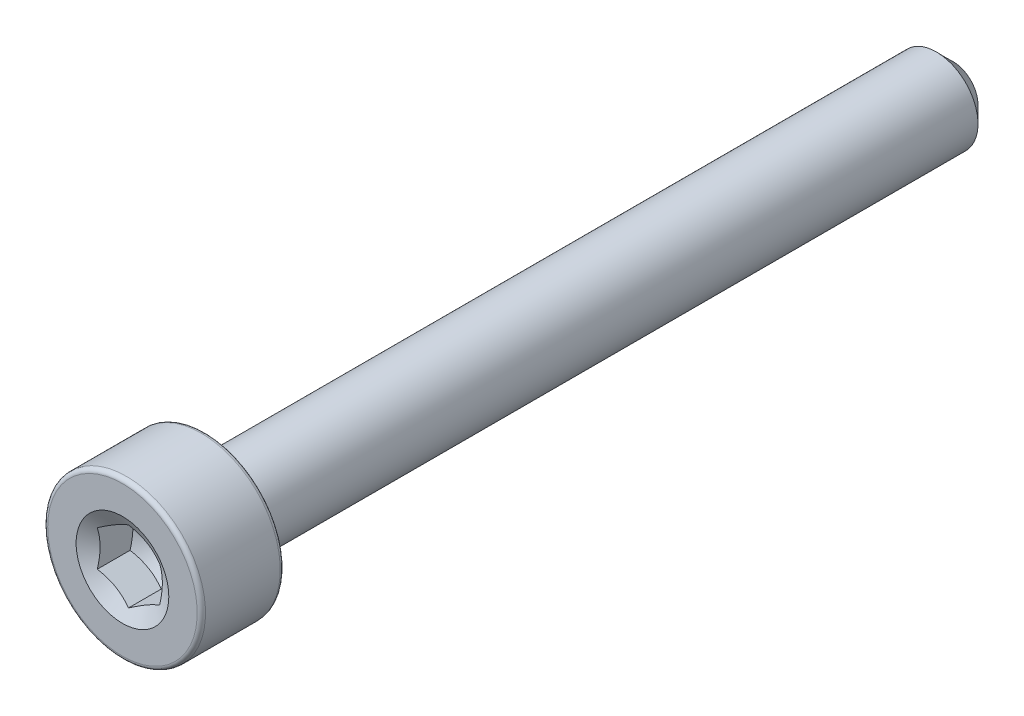
ISO-10303-21;
HEADER;
FILE_DESCRIPTION(('STEP AP214'),'2;1');
FILE_NAME('part.step','',(''),(''),'','','');
FILE_SCHEMA(('AUTOMOTIVE_DESIGN { 1 0 10303 214 1 1 1 1 }'));
ENDSEC;
DATA;
#1=APPLICATION_CONTEXT('core data for automotive mechanical design processes');
#2=APPLICATION_PROTOCOL_DEFINITION('international standard','automotive_design',2000,#1);
#3=PRODUCT_CONTEXT('',#1,'mechanical');
#4=PRODUCT('Part','Part','',(#3));
#5=PRODUCT_RELATED_PRODUCT_CATEGORY('part','',(#4));
#6=PRODUCT_DEFINITION_FORMATION('','',#4);
#7=PRODUCT_DEFINITION_CONTEXT('part definition',#1,'design');
#8=PRODUCT_DEFINITION('design','',#6,#7);
#9=PRODUCT_DEFINITION_SHAPE('','',#8);
#10=(LENGTH_UNIT() NAMED_UNIT(*) SI_UNIT(.MILLI.,.METRE.));
#11=(NAMED_UNIT(*) PLANE_ANGLE_UNIT() SI_UNIT($,.RADIAN.));
#12=(NAMED_UNIT(*) SI_UNIT($,.STERADIAN.) SOLID_ANGLE_UNIT());
#13=UNCERTAINTY_MEASURE_WITH_UNIT(LENGTH_MEASURE(1.E-05),#10,'distance_accuracy_value','');
#14=(GEOMETRIC_REPRESENTATION_CONTEXT(3) GLOBAL_UNCERTAINTY_ASSIGNED_CONTEXT((#13)) GLOBAL_UNIT_ASSIGNED_CONTEXT((#10,
#11,#12)) REPRESENTATION_CONTEXT('',''));
#15=CARTESIAN_POINT('',(0.,0.,0.));
#16=DIRECTION('',(0.,0.,1.));
#17=DIRECTION('',(1.,0.,0.));
#18=AXIS2_PLACEMENT_3D('',#15,#16,#17);
#19=CARTESIAN_POINT('',(0.,0.,-10.));
#20=DIRECTION('',(0.,0.,-1.));
#21=DIRECTION('',(-1.,0.,0.));
#22=AXIS2_PLACEMENT_3D('',#19,#20,#21);
#23=PLANE('',#22);
#24=CARTESIAN_POINT('',(0.,0.,-10.));
#25=DIRECTION('',(0.,0.,-1.));
#26=DIRECTION('',(-1.,0.,0.));
#27=AXIS2_PLACEMENT_3D('',#24,#25,#26);
#28=CIRCLE('',#27,0.600000000000008);
#29=CARTESIAN_POINT('',(-0.600000000000008,0.,-10.));
#30=VERTEX_POINT('',#29);
#31=EDGE_CURVE('E48',#30,#30,#28,.T.);
#32=ORIENTED_EDGE('',*,*,#31,.T.);
#33=EDGE_LOOP('',(#32));
#34=FACE_BOUND('',#33,.T.);
#35=ADVANCED_FACE('F35',(#34),#23,.T.);
#36=CARTESIAN_POINT('',(0.,0.,-10.));
#37=DIRECTION('',(0.,0.,1.));
#38=DIRECTION('',(1.,0.,0.));
#39=AXIS2_PLACEMENT_3D('',#36,#37,#38);
#40=CONICAL_SURFACE('',#39,0.600000000000008,0.785398163397452);
#41=CARTESIAN_POINT('',(0.,0.,-9.6));
#42=DIRECTION('',(0.,0.,-1.));
#43=DIRECTION('',(-1.,0.,0.));
#44=AXIS2_PLACEMENT_3D('',#41,#42,#43);
#45=CIRCLE('',#44,1.00000000000001);
#46=CARTESIAN_POINT('',(-1.00000000000001,0.,-9.6));
#47=VERTEX_POINT('',#46);
#48=EDGE_CURVE('E234',#47,#47,#45,.T.);
#49=ORIENTED_EDGE('',*,*,#48,.T.);
#50=EDGE_LOOP('',(#49));
#51=FACE_BOUND('',#50,.T.);
#52=ORIENTED_EDGE('',*,*,#31,.F.);
#53=EDGE_LOOP('',(#52));
#54=FACE_BOUND('',#53,.T.);
#55=ADVANCED_FACE('F224',(#51,#54),#40,.T.);
#56=CARTESIAN_POINT('',(0.,0.,-10.));
#57=DIRECTION('',(0.,0.,-1.));
#58=DIRECTION('',(-1.,0.,0.));
#59=AXIS2_PLACEMENT_3D('',#56,#57,#58);
#60=CYLINDRICAL_SURFACE('',#59,1.00000000000001);
#61=CARTESIAN_POINT('',(0.,0.,8.));
#62=DIRECTION('',(0.,0.,-1.));
#63=DIRECTION('',(-1.,0.,0.));
#64=AXIS2_PLACEMENT_3D('',#61,#62,#63);
#65=CIRCLE('',#64,1.00000000000001);
#66=CARTESIAN_POINT('',(-1.00000000000001,0.,8.));
#67=VERTEX_POINT('',#66);
#68=EDGE_CURVE('E236',#67,#67,#65,.T.);
#69=ORIENTED_EDGE('',*,*,#68,.T.);
#70=EDGE_LOOP('',(#69));
#71=FACE_BOUND('',#70,.T.);
#72=ORIENTED_EDGE('',*,*,#48,.F.);
#73=EDGE_LOOP('',(#72));
#74=FACE_BOUND('',#73,.T.);
#75=ADVANCED_FACE('F229',(#71,#74),#60,.T.);
#76=CARTESIAN_POINT('',(0.,1.,8.));
#77=DIRECTION('',(0.,0.,-1.));
#78=DIRECTION('',(-1.,0.,0.));
#79=AXIS2_PLACEMENT_3D('',#76,#77,#78);
#80=PLANE('',#79);
#81=CARTESIAN_POINT('',(0.,0.,8.));
#82=DIRECTION('',(0.,0.,-1.));
#83=DIRECTION('',(-1.,0.,0.));
#84=AXIS2_PLACEMENT_3D('',#81,#82,#83);
#85=CIRCLE('',#84,1.8);
#86=CARTESIAN_POINT('',(-1.8,0.,8.));
#87=VERTEX_POINT('',#86);
#88=EDGE_CURVE('E241',#87,#87,#85,.T.);
#89=ORIENTED_EDGE('',*,*,#88,.T.);
#90=EDGE_LOOP('',(#89));
#91=FACE_BOUND('',#90,.T.);
#92=ORIENTED_EDGE('',*,*,#68,.F.);
#93=EDGE_LOOP('',(#92));
#94=FACE_BOUND('',#93,.T.);
#95=ADVANCED_FACE('F325',(#91,#94),#80,.T.);
#96=CARTESIAN_POINT('',(0.,0.,8.1));
#97=DIRECTION('',(0.,0.,-1.));
#98=DIRECTION('',(-1.,0.,0.));
#99=AXIS2_PLACEMENT_3D('',#96,#97,#98);
#100=TOROIDAL_SURFACE('',#99,1.8,0.0999999999999996);
#101=CARTESIAN_POINT('',(0.,0.,8.1));
#102=DIRECTION('',(0.,0.,-1.));
#103=DIRECTION('',(-1.,0.,0.));
#104=AXIS2_PLACEMENT_3D('',#101,#102,#103);
#105=CIRCLE('',#104,1.9);
#106=CARTESIAN_POINT('',(-1.9,0.,8.1));
#107=VERTEX_POINT('',#106);
#108=EDGE_CURVE('E244',#107,#107,#105,.T.);
#109=ORIENTED_EDGE('',*,*,#108,.T.);
#110=EDGE_LOOP('',(#109));
#111=FACE_BOUND('',#110,.T.);
#112=ORIENTED_EDGE('',*,*,#88,.F.);
#113=EDGE_LOOP('',(#112));
#114=FACE_BOUND('',#113,.T.);
#115=ADVANCED_FACE('F318',(#111,#114),#100,.T.);
#116=CARTESIAN_POINT('',(0.,0.,-10.));
#117=DIRECTION('',(0.,0.,-1.));
#118=DIRECTION('',(-1.,0.,0.));
#119=AXIS2_PLACEMENT_3D('',#116,#117,#118);
#120=CYLINDRICAL_SURFACE('',#119,1.9);
#121=CARTESIAN_POINT('',(0.,0.,9.9));
#122=DIRECTION('',(0.,0.,-1.));
#123=DIRECTION('',(-1.,0.,0.));
#124=AXIS2_PLACEMENT_3D('',#121,#122,#123);
#125=CIRCLE('',#124,1.9);
#126=CARTESIAN_POINT('',(-1.9,0.,9.9));
#127=VERTEX_POINT('',#126);
#128=EDGE_CURVE('E246',#127,#127,#125,.T.);
#129=ORIENTED_EDGE('',*,*,#128,.T.);
#130=EDGE_LOOP('',(#129));
#131=FACE_BOUND('',#130,.T.);
#132=ORIENTED_EDGE('',*,*,#108,.F.);
#133=EDGE_LOOP('',(#132));
#134=FACE_BOUND('',#133,.T.);
#135=ADVANCED_FACE('F263',(#131,#134),#120,.T.);
#136=CARTESIAN_POINT('',(0.,0.,9.9));
#137=DIRECTION('',(0.,0.,-1.));
#138=DIRECTION('',(-1.,0.,0.));
#139=AXIS2_PLACEMENT_3D('',#136,#137,#138);
#140=TOROIDAL_SURFACE('',#139,1.8,0.0999999999999996);
#141=CARTESIAN_POINT('',(0.,0.,10.));
#142=DIRECTION('',(0.,0.,-1.));
#143=DIRECTION('',(-1.,0.,0.));
#144=AXIS2_PLACEMENT_3D('',#141,#142,#143);
#145=CIRCLE('',#144,1.8);
#146=CARTESIAN_POINT('',(-1.8,0.,10.));
#147=VERTEX_POINT('',#146);
#148=EDGE_CURVE('E122',#147,#147,#145,.T.);
#149=ORIENTED_EDGE('',*,*,#148,.T.);
#150=EDGE_LOOP('',(#149));
#151=FACE_BOUND('',#150,.T.);
#152=ORIENTED_EDGE('',*,*,#128,.F.);
#153=EDGE_LOOP('',(#152));
#154=FACE_BOUND('',#153,.T.);
#155=ADVANCED_FACE('F253',(#151,#154),#140,.T.);
#156=CARTESIAN_POINT('',(0.,1.79999999999999,10.));
#157=DIRECTION('',(0.,0.,1.));
#158=DIRECTION('',(1.,0.,0.));
#159=AXIS2_PLACEMENT_3D('',#156,#157,#158);
#160=PLANE('',#159);
#161=CARTESIAN_POINT('',(0.,0.,10.));
#162=DIRECTION('',(0.,0.,1.));
#163=DIRECTION('',(1.,0.,0.));
#164=AXIS2_PLACEMENT_3D('',#161,#162,#163);
#165=CIRCLE('',#164,1.11602540378444);
#166=CARTESIAN_POINT('',(1.11602540378444,0.,10.));
#167=VERTEX_POINT('',#166);
#168=EDGE_CURVE('E266',#167,#167,#165,.T.);
#169=ORIENTED_EDGE('',*,*,#168,.F.);
#170=EDGE_LOOP('',(#169));
#171=FACE_BOUND('',#170,.T.);
#172=ORIENTED_EDGE('',*,*,#148,.F.);
#173=EDGE_LOOP('',(#172));
#174=FACE_BOUND('',#173,.T.);
#175=ADVANCED_FACE('F133',(#171,#174),#160,.T.);
#176=CARTESIAN_POINT('',(0.,0.,10.));
#177=DIRECTION('',(0.,0.,1.));
#178=DIRECTION('',(1.,0.,0.));
#179=AXIS2_PLACEMENT_3D('',#176,#177,#178);
#180=CONICAL_SURFACE('',#179,1.11602540378444,1.0471975511966);
#181=ORIENTED_EDGE('',*,*,#168,.T.);
#182=EDGE_LOOP('',(#181));
#183=FACE_BOUND('',#182,.T.);
#184=CARTESIAN_POINT('',(0.750199999999995,0.432897231838378,9.85572911270082));
#185=CARTESIAN_POINT('',(0.717238666575999,0.451927466563571,9.844734465448));
#186=CARTESIAN_POINT('',(0.683992818696244,0.471121965786385,9.83473457387216));
#187=CARTESIAN_POINT('',(0.616925218141238,0.50984346302072,9.81727814462867));
#188=CARTESIAN_POINT('',(0.583102272153648,0.529371149991441,9.80982778503158));
#189=CARTESIAN_POINT('',(0.515875632570357,0.568184468451568,9.79822813644186));
#190=CARTESIAN_POINT('',(0.482482293499608,0.587464121753206,9.79400168090746));
#191=CARTESIAN_POINT('',(0.4155381739113,0.626114327218178,9.78895257864927));
#192=CARTESIAN_POINT('',(0.381987637355581,0.645484738530079,9.78812575463677));
#193=CARTESIAN_POINT('',(0.319275698978877,0.681691493033272,9.78982920074236));
#194=CARTESIAN_POINT('',(0.290104995811369,0.698533206359483,9.79194121207614));
#195=CARTESIAN_POINT('',(0.231953671848453,0.732106888903206,9.79864022050677));
#196=CARTESIAN_POINT('',(0.202973252776871,0.748838741655412,9.80322951465607));
#197=CARTESIAN_POINT('',(0.14470165065519,0.782481866826475,9.81470442958304));
#198=CARTESIAN_POINT('',(0.115417857581379,0.799388872640534,9.82163878037239));
#199=CARTESIAN_POINT('',(0.0572874895838308,0.83295045625201,9.83737781029697));
#200=CARTESIAN_POINT('',(0.0284401676519281,0.849605465334794,9.84617878188886));
#201=CARTESIAN_POINT('',(-0.000200000000000187,0.86614087383827,9.85572911270082));
#202=B_SPLINE_CURVE_WITH_KNOTS('',3,(#184,#185,#186,#187,#188,#189,#190,#191,#192,#193,#194,
#195,#196,#197,#198,#199,#200,#201),.UNSPECIFIED.,.F.,.F.,(4,2,2,2,2,2,2,2,4),(0.,
0.118896819359342,0.238079744533806,0.354311719456402,0.470400831872516,0.571553114284105,
0.672799351342652,0.776293900714044,0.879584779344043),.UNSPECIFIED.);
#203=CARTESIAN_POINT('',(0.749999999999995,0.433012701892216,9.8556624327026));
#204=VERTEX_POINT('',#203);
#205=CARTESIAN_POINT('',(0.,0.866025403784432,9.8556624327026));
#206=VERTEX_POINT('',#205);
#207=EDGE_CURVE('E105',#204,#206,#202,.T.);
#208=ORIENTED_EDGE('',*,*,#207,.F.);
#209=CARTESIAN_POINT('',(0.749999999999995,-1.15306564243728,10.149820346422));
#210=CARTESIAN_POINT('',(0.749999999999995,-1.12038013476138,10.1340040192738));
#211=CARTESIAN_POINT('',(0.749999999999995,-1.08761885655996,10.1183449923525));
#212=CARTESIAN_POINT('',(0.749999999999995,-1.02190345027715,10.087423399602));
#213=CARTESIAN_POINT('',(0.749999999999995,-0.988949291795743,10.0721608984503));
#214=CARTESIAN_POINT('',(0.749999999999995,-0.889385711742106,10.0269325139052));
#215=CARTESIAN_POINT('',(0.749999999999995,-0.822435952381775,9.99770261181999));
#216=CARTESIAN_POINT('',(0.749999999999995,-0.685214684307736,9.94149405530837));
#217=CARTESIAN_POINT('',(0.749999999999995,-0.614903922449347,9.91461006312454));
#218=CARTESIAN_POINT('',(0.749999999999995,-0.472489622951485,9.86636033068312));
#219=CARTESIAN_POINT('',(0.749999999999995,-0.400390831340974,9.84498140445166));
#220=CARTESIAN_POINT('',(0.749999999999995,-0.290845866621627,9.81969809707652));
#221=CARTESIAN_POINT('',(0.749999999999995,-0.254190393438377,9.81241088336631));
#222=CARTESIAN_POINT('',(0.749999999999995,-0.180433464698268,9.8005602351846));
#223=CARTESIAN_POINT('',(0.749999999999995,-0.143332051443239,9.79599654440802));
#224=CARTESIAN_POINT('',(0.749999999999995,-0.0693492730770007,9.79001551285672));
#225=CARTESIAN_POINT('',(0.749999999999995,-0.0324712047402484,9.78855850283831));
#226=CARTESIAN_POINT('',(0.749999999999995,0.0412735455883394,9.78880667745323));
#227=CARTESIAN_POINT('',(0.749999999999995,0.0781402270398259,9.79051199426122));
#228=CARTESIAN_POINT('',(0.749999999999995,0.167158676596212,9.79829783053029));
#229=CARTESIAN_POINT('',(0.749999999999995,0.219175882572991,9.80592459994543));
#230=CARTESIAN_POINT('',(0.749999999999995,0.322252348155704,9.82611456877775));
#231=CARTESIAN_POINT('',(0.749999999999995,0.373310451134433,9.83868337195179));
#232=CARTESIAN_POINT('',(0.749999999999995,0.475553995689897,9.86772435118418));
#233=CARTESIAN_POINT('',(0.749999999999995,0.526715064342417,9.88428009146391));
#234=CARTESIAN_POINT('',(0.749999999999995,0.628087874613356,9.91998725823706));
#235=CARTESIAN_POINT('',(0.749999999999995,0.678299881547945,9.93913794669093));
#236=CARTESIAN_POINT('',(0.749999999999995,0.812229232348719,9.99298526882848));
#237=CARTESIAN_POINT('',(0.749999999999995,0.895278140104571,10.0293270483095));
#238=CARTESIAN_POINT('',(0.749999999999995,1.06008280877548,10.1048396276005));
#239=CARTESIAN_POINT('',(0.749999999999995,1.14183809619828,10.1440114353385));
#240=CARTESIAN_POINT('',(0.749999999999995,1.30462051464699,10.2241336520939));
#241=CARTESIAN_POINT('',(0.749999999999995,1.38564638020701,10.2650866225652));
#242=CARTESIAN_POINT('',(0.749999999999995,1.54711446948511,10.3480870099448));
#243=CARTESIAN_POINT('',(0.749999999999995,1.62755679099578,10.3901342377892));
#244=CARTESIAN_POINT('',(0.749999999999995,1.77972541583155,10.4705750296754));
#245=CARTESIAN_POINT('',(0.749999999999995,1.85149053346193,10.508895325344));
#246=CARTESIAN_POINT('',(0.749999999999995,1.99478895544011,10.5859749320338));
#247=CARTESIAN_POINT('',(0.749999999999995,2.06632224789951,10.6247342651255));
#248=CARTESIAN_POINT('',(0.749999999999995,2.20899357077631,10.7024604591111));
#249=CARTESIAN_POINT('',(0.749999999999995,2.28013214156243,10.7414263293028));
#250=CARTESIAN_POINT('',(0.749999999999995,2.42226538717498,10.8196086100366));
#251=CARTESIAN_POINT('',(0.749999999999995,2.49326007122855,10.8588250037974));
#252=CARTESIAN_POINT('',(0.749999999999995,2.56420394114665,10.8981325136433));
#253=B_SPLINE_CURVE_WITH_KNOTS('',3,(#209,#210,#211,#212,#213,#214,#215,#216,#217,#218,#219,
#220,#221,#222,#223,#224,#225,#226,#227,#228,#229,#230,#231,#232,#233,#234,#235,#236,#237,#238,
#239,#240,#241,#242,#243,#244,#245,#246,#247,#248,#249,#250,#251,#252),.UNSPECIFIED.,.F.,.F.,(4,
2,2,2,2,2,2,2,2,2,2,2,2,2,2,2,2,2,2,2,2,4),(0.,0.108931784246396,0.217881226266119,
0.436985147205167,0.662706864209844,0.887882785097108,0.999918258084864,1.11194318598395,
1.22252888150385,1.33311919923941,1.49051448653736,1.64808876093355,1.80930789324034,
1.97048126844009,2.24232664131636,2.51426931510376,2.78661690583715,3.05891774918372,
3.30298150798587,3.54705759078482,3.79039079075098,4.0337078585585),.UNSPECIFIED.);
#254=CARTESIAN_POINT('',(0.749999999999994,-0.433012701892216,9.85566243270259));
#255=VERTEX_POINT('',#254);
#256=EDGE_CURVE('E187',#255,#204,#253,.T.);
#257=ORIENTED_EDGE('',*,*,#256,.F.);
#258=CARTESIAN_POINT('',(-0.000200000000000048,-0.86614087383827,9.85572911270081));
#259=CARTESIAN_POINT('',(0.0327613334239947,-0.847110639113078,9.84473446544799));
#260=CARTESIAN_POINT('',(0.0660071813037482,-0.827916139890265,9.83473457387215));
#261=CARTESIAN_POINT('',(0.133074781858752,-0.789194642655931,9.81727814462866));
#262=CARTESIAN_POINT('',(0.166897727846341,-0.76966695568521,9.80982778503157));
#263=CARTESIAN_POINT('',(0.234124367429631,-0.730853637225084,9.79822813644184));
#264=CARTESIAN_POINT('',(0.267517706500379,-0.711573983923447,9.79400168090745));
#265=CARTESIAN_POINT('',(0.334461826088685,-0.672923778458476,9.78895257864925));
#266=CARTESIAN_POINT('',(0.368012362644403,-0.653553367146576,9.78812575463675));
#267=CARTESIAN_POINT('',(0.430724301021107,-0.617346612643383,9.78982920074234));
#268=CARTESIAN_POINT('',(0.459895004188616,-0.600504899317171,9.79194121207613));
#269=CARTESIAN_POINT('',(0.518046328151533,-0.566931216773447,9.79864022050675));
#270=CARTESIAN_POINT('',(0.547026747223117,-0.55019936402124,9.80322951465605));
#271=CARTESIAN_POINT('',(0.6052983493448,-0.516556238850176,9.81470442958302));
#272=CARTESIAN_POINT('',(0.634582142418612,-0.499649233036117,9.82163878037237));
#273=CARTESIAN_POINT('',(0.692712510416162,-0.46608764942464,9.83737781029695));
#274=CARTESIAN_POINT('',(0.721559832348065,-0.449432640341856,9.84617878188884));
#275=CARTESIAN_POINT('',(0.750199999999995,-0.432897231838378,9.85572911270081));
#276=B_SPLINE_CURVE_WITH_KNOTS('',3,(#258,#259,#260,#261,#262,#263,#264,#265,#266,#267,#268,
#269,#270,#271,#272,#273,#274,#275),.UNSPECIFIED.,.F.,.F.,(4,2,2,2,2,2,2,2,4),(0.,
0.118896819359338,0.238079744533799,0.354311719456392,0.470400831872503,0.571553114284095,
0.672799351342646,0.776293900714041,0.879584779344044),.UNSPECIFIED.);
#277=CARTESIAN_POINT('',(0.,-0.866025403784432,9.85566243270258));
#278=VERTEX_POINT('',#277);
#279=EDGE_CURVE('E198',#278,#255,#276,.T.);
#280=ORIENTED_EDGE('',*,*,#279,.F.);
#281=CARTESIAN_POINT('',(-0.750199999999994,-0.432897231838379,9.85572911270081));
#282=CARTESIAN_POINT('',(-0.717238666575999,-0.451927466563572,9.84473446544799));
#283=CARTESIAN_POINT('',(-0.683992818696245,-0.471121965786385,9.83473457387215));
#284=CARTESIAN_POINT('',(-0.616925218141241,-0.509843463020719,9.81727814462866));
#285=CARTESIAN_POINT('',(-0.583102272153652,-0.529371149991439,9.80982778503157));
#286=CARTESIAN_POINT('',(-0.515875632570362,-0.568184468451566,9.79822813644184));
#287=CARTESIAN_POINT('',(-0.482482293499613,-0.587464121753203,9.79400168090745));
#288=CARTESIAN_POINT('',(-0.415538173911307,-0.626114327218174,9.78895257864925));
#289=CARTESIAN_POINT('',(-0.381987637355589,-0.645484738530074,9.78812575463675));
#290=CARTESIAN_POINT('',(-0.319275698978885,-0.681691493033267,9.78982920074234));
#291=CARTESIAN_POINT('',(-0.290104995811376,-0.698533206359479,9.79194121207612));
#292=CARTESIAN_POINT('',(-0.23195367184846,-0.732106888903202,9.79864022050675));
#293=CARTESIAN_POINT('',(-0.202973252776876,-0.748838741655409,9.80322951465605));
#294=CARTESIAN_POINT('',(-0.144701650655194,-0.782481866826473,9.81470442958302));
#295=CARTESIAN_POINT('',(-0.115417857581382,-0.799388872640532,9.82163878037237));
#296=CARTESIAN_POINT('',(-0.0572874895838322,-0.832950456252009,9.83737781029695));
#297=CARTESIAN_POINT('',(-0.0284401676519287,-0.849605465334793,9.84617878188884));
#298=CARTESIAN_POINT('',(0.000200000000000193,-0.86614087383827,9.85572911270081));
#299=B_SPLINE_CURVE_WITH_KNOTS('',3,(#281,#282,#283,#284,#285,#286,#287,#288,#289,#290,#291,
#292,#293,#294,#295,#296,#297,#298),.UNSPECIFIED.,.F.,.F.,(4,2,2,2,2,2,2,2,4),(0.,
0.118896819359338,0.238079744533801,0.354311719456394,0.470400831872506,0.571553114284096,
0.672799351342646,0.776293900714041,0.879584779344043),.UNSPECIFIED.);
#300=CARTESIAN_POINT('',(-0.749999999999994,-0.433012701892217,9.85566243270259));
#301=VERTEX_POINT('',#300);
#302=EDGE_CURVE('E55',#301,#278,#299,.T.);
#303=ORIENTED_EDGE('',*,*,#302,.F.);
#304=CARTESIAN_POINT('',(-0.749999999999993,-1.15306564243728,10.149820346422));
#305=CARTESIAN_POINT('',(-0.749999999999993,-1.12038013476138,10.1340040192737));
#306=CARTESIAN_POINT('',(-0.749999999999993,-1.08761885655996,10.1183449923525));
#307=CARTESIAN_POINT('',(-0.749999999999993,-1.02190345027715,10.087423399602));
#308=CARTESIAN_POINT('',(-0.749999999999994,-0.988949291795742,10.0721608984503));
#309=CARTESIAN_POINT('',(-0.749999999999994,-0.889385711742105,10.0269325139052));
#310=CARTESIAN_POINT('',(-0.749999999999994,-0.822435952381774,9.99770261181998));
#311=CARTESIAN_POINT('',(-0.749999999999994,-0.685214684307735,9.94149405530837));
#312=CARTESIAN_POINT('',(-0.749999999999994,-0.614903922449346,9.91461006312453));
#313=CARTESIAN_POINT('',(-0.749999999999994,-0.472489622951485,9.86636033068312));
#314=CARTESIAN_POINT('',(-0.749999999999994,-0.400390831340974,9.84498140445166));
#315=CARTESIAN_POINT('',(-0.749999999999994,-0.290845866621628,9.81969809707652));
#316=CARTESIAN_POINT('',(-0.749999999999994,-0.254190393438378,9.81241088336631));
#317=CARTESIAN_POINT('',(-0.749999999999994,-0.180433464698269,9.8005602351846));
#318=CARTESIAN_POINT('',(-0.749999999999994,-0.14333205144324,9.79599654440802));
#319=CARTESIAN_POINT('',(-0.749999999999994,-0.0693492730770015,9.79001551285672));
#320=CARTESIAN_POINT('',(-0.749999999999994,-0.0324712047402493,9.78855850283831));
#321=CARTESIAN_POINT('',(-0.749999999999994,0.0412735455883386,9.78880667745323));
#322=CARTESIAN_POINT('',(-0.749999999999994,0.0781402270398251,9.79051199426122));
#323=CARTESIAN_POINT('',(-0.749999999999994,0.167158676596211,9.79829783053029));
#324=CARTESIAN_POINT('',(-0.749999999999994,0.21917588257299,9.80592459994544));
#325=CARTESIAN_POINT('',(-0.749999999999994,0.322252348155703,9.82611456877775));
#326=CARTESIAN_POINT('',(-0.749999999999994,0.373310451134432,9.83868337195179));
#327=CARTESIAN_POINT('',(-0.749999999999994,0.475553995689896,9.86772435118418));
#328=CARTESIAN_POINT('',(-0.749999999999994,0.526715064342415,9.88428009146391));
#329=CARTESIAN_POINT('',(-0.749999999999994,0.628087874613353,9.91998725823706));
#330=CARTESIAN_POINT('',(-0.749999999999994,0.678299881547943,9.93913794669093));
#331=CARTESIAN_POINT('',(-0.749999999999994,0.812229232348717,9.99298526882847));
#332=CARTESIAN_POINT('',(-0.749999999999994,0.895278140104569,10.0293270483095));
#333=CARTESIAN_POINT('',(-0.749999999999995,1.06008280877548,10.1048396276005));
#334=CARTESIAN_POINT('',(-0.749999999999995,1.14183809619827,10.1440114353385));
#335=CARTESIAN_POINT('',(-0.749999999999995,1.30462051464699,10.2241336520939));
#336=CARTESIAN_POINT('',(-0.749999999999995,1.38564638020701,10.2650866225652));
#337=CARTESIAN_POINT('',(-0.749999999999995,1.54711446948511,10.3480870099448));
#338=CARTESIAN_POINT('',(-0.749999999999995,1.62755679099578,10.3901342377892));
#339=CARTESIAN_POINT('',(-0.749999999999995,1.77972541583155,10.4705750296754));
#340=CARTESIAN_POINT('',(-0.749999999999995,1.85149053346193,10.508895325344));
#341=CARTESIAN_POINT('',(-0.749999999999995,1.99478895544011,10.5859749320338));
#342=CARTESIAN_POINT('',(-0.749999999999995,2.06632224789951,10.6247342651255));
#343=CARTESIAN_POINT('',(-0.749999999999995,2.20899357077631,10.7024604591111));
#344=CARTESIAN_POINT('',(-0.749999999999995,2.28013214156243,10.7414263293028));
#345=CARTESIAN_POINT('',(-0.749999999999995,2.42226538717498,10.8196086100366));
#346=CARTESIAN_POINT('',(-0.749999999999995,2.49326007122855,10.8588250037974));
#347=CARTESIAN_POINT('',(-0.749999999999995,2.56420394114665,10.8981325136433));
#348=B_SPLINE_CURVE_WITH_KNOTS('',3,(#304,#305,#306,#307,#308,#309,#310,#311,#312,#313,#314,
#315,#316,#317,#318,#319,#320,#321,#322,#323,#324,#325,#326,#327,#328,#329,#330,#331,#332,#333,
#334,#335,#336,#337,#338,#339,#340,#341,#342,#343,#344,#345,#346,#347),.UNSPECIFIED.,.F.,.F.,(4,
2,2,2,2,2,2,2,2,2,2,2,2,2,2,2,2,2,2,2,2,4),(0.,0.108931784246398,0.217881226266121,
0.436985147205169,0.662706864209845,0.887882785097107,0.999918258084863,1.11194318598395,
1.22252888150385,1.33311919923941,1.49051448653735,1.64808876093355,1.80930789324034,
1.97048126844009,2.24232664131636,2.51426931510376,2.78661690583715,3.05891774918372,
3.30298150798587,3.54705759078482,3.79039079075098,4.0337078585585),.UNSPECIFIED.);
#349=CARTESIAN_POINT('',(-0.749999999999994,0.433012701892216,9.8556624327026));
#350=VERTEX_POINT('',#349);
#351=EDGE_CURVE('E11',#350,#301,#348,.F.);
#352=ORIENTED_EDGE('',*,*,#351,.F.);
#353=CARTESIAN_POINT('',(0.00020000000000018,0.86614087383827,9.85572911270082));
#354=CARTESIAN_POINT('',(-0.0327613334239955,0.847110639113077,9.84473446544801));
#355=CARTESIAN_POINT('',(-0.0660071813037505,0.827916139890264,9.83473457387216));
#356=CARTESIAN_POINT('',(-0.133074781858757,0.789194642655928,9.81727814462868));
#357=CARTESIAN_POINT('',(-0.166897727846347,0.769666955685207,9.80982778503159));
#358=CARTESIAN_POINT('',(-0.23412436742964,0.730853637225079,9.79822813644186));
#359=CARTESIAN_POINT('',(-0.267517706500389,0.711573983923442,9.79400168090746));
#360=CARTESIAN_POINT('',(-0.334461826088697,0.672923778458469,9.78895257864927));
#361=CARTESIAN_POINT('',(-0.368012362644417,0.653553367146568,9.78812575463677));
#362=CARTESIAN_POINT('',(-0.43072430102112,0.617346612643375,9.78982920074236));
#363=CARTESIAN_POINT('',(-0.459895004188629,0.600504899317164,9.79194121207614));
#364=CARTESIAN_POINT('',(-0.518046328151543,0.566931216773442,9.79864022050677));
#365=CARTESIAN_POINT('',(-0.547026747223125,0.550199364021236,9.80322951465607));
#366=CARTESIAN_POINT('',(-0.605298349344806,0.516556238850173,9.81470442958303));
#367=CARTESIAN_POINT('',(-0.634582142418617,0.499649233036115,9.82163878037239));
#368=CARTESIAN_POINT('',(-0.692712510416164,0.466087649424639,9.83737781029696));
#369=CARTESIAN_POINT('',(-0.721559832348067,0.449432640341855,9.84617878188885));
#370=CARTESIAN_POINT('',(-0.750199999999994,0.432897231838379,9.85572911270082));
#371=B_SPLINE_CURVE_WITH_KNOTS('',3,(#353,#354,#355,#356,#357,#358,#359,#360,#361,#362,#363,
#364,#365,#366,#367,#368,#369,#370),.UNSPECIFIED.,.F.,.F.,(4,2,2,2,2,2,2,2,4),(0.,
0.118896819359342,0.238079744533808,0.354311719456405,0.470400831872521,0.571553114284108,
0.672799351342655,0.776293900714045,0.879584779344043),.UNSPECIFIED.);
#372=EDGE_CURVE('E91',#206,#350,#371,.T.);
#373=ORIENTED_EDGE('',*,*,#372,.F.);
#374=EDGE_LOOP('',(#208,#257,#280,#303,#352,#373));
#375=FACE_BOUND('',#374,.T.);
#376=ADVANCED_FACE('F90',(#183,#375),#180,.F.);
#377=CARTESIAN_POINT('',(0.,0.,9.));
#378=DIRECTION('',(0.,0.,1.));
#379=DIRECTION('',(1.,0.,0.));
#380=AXIS2_PLACEMENT_3D('',#377,#378,#379);
#381=CONICAL_SURFACE('',#380,0.75,1.0471975511966);
#382=CARTESIAN_POINT('',(0.,0.,8.56698729810778));
#383=VERTEX_POINT('',#382);
#384=VERTEX_LOOP('',#383);
#385=FACE_BOUND('',#384,.T.);
#386=CARTESIAN_POINT('',(0.750199999999995,-0.432897231838378,9.067053978106));
#387=CARTESIAN_POINT('',(0.717238666576,-0.451927466563571,9.05605933085318));
#388=CARTESIAN_POINT('',(0.683992818696245,-0.471121965786384,9.04605943927734));
#389=CARTESIAN_POINT('',(0.61692521814124,-0.509843463020719,9.02860301003385));
#390=CARTESIAN_POINT('',(0.583102272153651,-0.52937114999144,9.02115265043676));
#391=CARTESIAN_POINT('',(0.51587563257036,-0.568184468451567,9.00955300184703));
#392=CARTESIAN_POINT('',(0.482482293499611,-0.587464121753204,9.00532654631264));
#393=CARTESIAN_POINT('',(0.415538173911304,-0.626114327218176,9.00027744405444));
#394=CARTESIAN_POINT('',(0.381987637355585,-0.645484738530076,8.99945062004194));
#395=CARTESIAN_POINT('',(0.319275698978882,-0.681691493033269,9.00115406614753));
#396=CARTESIAN_POINT('',(0.290104995811373,-0.698533206359481,9.00326607748132));
#397=CARTESIAN_POINT('',(0.231953671848457,-0.732106888903204,9.00996508591194));
#398=CARTESIAN_POINT('',(0.202973252776874,-0.74883874165541,9.01455438006124));
#399=CARTESIAN_POINT('',(0.144701650655192,-0.782481866826474,9.02602929498821));
#400=CARTESIAN_POINT('',(0.11541785758138,-0.799388872640533,9.03296364577757));
#401=CARTESIAN_POINT('',(0.0572874895838312,-0.83295045625201,9.04870267570214));
#402=CARTESIAN_POINT('',(0.0284401676519282,-0.849605465334794,9.05750364729403));
#403=CARTESIAN_POINT('',(-0.000200000000000209,-0.86614087383827,9.067053978106));
#404=B_SPLINE_CURVE_WITH_KNOTS('',3,(#386,#387,#388,#389,#390,#391,#392,#393,#394,#395,#396,
#397,#398,#399,#400,#401,#402,#403),.UNSPECIFIED.,.F.,.F.,(4,2,2,2,2,2,2,2,4),(0.,
0.11889681935934,0.238079744533803,0.354311719456398,0.470400831872511,0.571553114284101,
0.67279935134265,0.776293900714044,0.879584779344044),.UNSPECIFIED.);
#405=CARTESIAN_POINT('',(0.749999999999995,-0.433012701892216,9.06698729810778));
#406=VERTEX_POINT('',#405);
#407=CARTESIAN_POINT('',(0.,-0.866025403784432,9.06698729810777));
#408=VERTEX_POINT('',#407);
#409=EDGE_CURVE('E148',#406,#408,#404,.T.);
#410=ORIENTED_EDGE('',*,*,#409,.F.);
#411=CARTESIAN_POINT('',(0.749999999999995,-1.16819086071881,9.36847963266604));
#412=CARTESIAN_POINT('',(0.749999999999995,-1.13536850898041,9.35253590269945));
#413=CARTESIAN_POINT('',(0.749999999999995,-1.10247164130993,9.33674628322334));
#414=CARTESIAN_POINT('',(0.749999999999995,-1.03648837590991,9.30555519560256));
#415=CARTESIAN_POINT('',(0.749999999999995,-1.00340194965645,9.29015378786287));
#416=CARTESIAN_POINT('',(0.749999999999995,-0.903461361323815,9.24449860455481));
#417=CARTESIAN_POINT('',(0.749999999999995,-0.836272683260854,9.21496446851571));
#418=CARTESIAN_POINT('',(0.749999999999995,-0.698511531447613,9.15803655806788));
#419=CARTESIAN_POINT('',(0.749999999999995,-0.627898964314548,9.13073868868732));
#420=CARTESIAN_POINT('',(0.749999999999995,-0.484886096035179,9.08155103687295));
#421=CARTESIAN_POINT('',(0.749999999999995,-0.412490292921,9.05964892848689));
#422=CARTESIAN_POINT('',(0.749999999999995,-0.302473087894524,9.03349567536561));
#423=CARTESIAN_POINT('',(0.749999999999995,-0.265655800827959,9.02590509486307));
#424=CARTESIAN_POINT('',(0.749999999999995,-0.191557488685926,9.01343204227398));
#425=CARTESIAN_POINT('',(0.749999999999995,-0.154276516838761,9.00854926222843));
#426=CARTESIAN_POINT('',(0.749999999999995,-0.0799244942854072,9.00194302641301));
#427=CARTESIAN_POINT('',(0.749999999999995,-0.0428571779270415,9.00017868129603));
#428=CARTESIAN_POINT('',(0.749999999999995,0.0312923752540686,8.99984705745223));
#429=CARTESIAN_POINT('',(0.749999999999995,0.0683746127674286,9.00127994932615));
#430=CARTESIAN_POINT('',(0.749999999999995,0.156963484421977,9.00839824324391));
#431=CARTESIAN_POINT('',(0.749999999999995,0.208353121334506,9.01554584531399));
#432=CARTESIAN_POINT('',(0.749999999999995,0.310220465945908,9.03474720377815));
#433=CARTESIAN_POINT('',(0.749999999999995,0.360697105526626,9.04680636172036));
#434=CARTESIAN_POINT('',(0.749999999999995,0.43626570713336,9.06776166246771));
#435=CARTESIAN_POINT('',(0.749999999999995,0.461739721583067,9.07533496302793));
#436=CARTESIAN_POINT('',(0.749999999999995,0.512423301025693,9.09127277147244));
#437=CARTESIAN_POINT('',(0.749999999999995,0.537633013731209,9.09963680801326));
#438=CARTESIAN_POINT('',(0.749999999999995,0.587819998222205,9.11702648946396));
#439=CARTESIAN_POINT('',(0.749999999999995,0.612797282051364,9.12605209987576));
#440=CARTESIAN_POINT('',(0.749999999999995,0.662547469239369,9.14465820802481));
#441=CARTESIAN_POINT('',(0.749999999999995,0.687320343795814,9.15423878248417));
#442=CARTESIAN_POINT('',(0.749999999999995,0.77039949899964,9.187259144684));
#443=CARTESIAN_POINT('',(0.749999999999995,0.828286480168938,9.21175338504037));
#444=CARTESIAN_POINT('',(0.749999999999995,0.943314842554605,9.26244149769109));
#445=CARTESIAN_POINT('',(0.749999999999995,1.00045605246112,9.28863575251782));
#446=CARTESIAN_POINT('',(0.749999999999995,1.11421797205774,9.34220737835324));
#447=CARTESIAN_POINT('',(0.749999999999995,1.17083837413214,9.36958540016983));
#448=CARTESIAN_POINT('',(0.749999999999995,1.28367024573723,9.42517340492553));
#449=CARTESIAN_POINT('',(0.749999999999995,1.33988169793003,9.45338342288474));
#450=CARTESIAN_POINT('',(0.749999999999995,1.50831871506048,9.53904061400061));
#451=CARTESIAN_POINT('',(0.749999999999995,1.6200851477135,9.59738874487154));
#452=CARTESIAN_POINT('',(0.749999999999995,1.84285322752674,9.71541903773344));
#453=CARTESIAN_POINT('',(0.749999999999995,1.95385513787952,9.77510070717301));
#454=CARTESIAN_POINT('',(0.749999999999995,2.15917508176212,9.88652004284534));
#455=CARTESIAN_POINT('',(0.749999999999995,2.25355629089745,9.93814140901853));
#456=CARTESIAN_POINT('',(0.749999999999995,2.44208742135968,10.0418286119257));
#457=CARTESIAN_POINT('',(0.749999999999995,2.53623731606008,10.0938944970005));
#458=CARTESIAN_POINT('',(0.749999999999995,2.72396207908743,10.1981226197787));
#459=CARTESIAN_POINT('',(0.749999999999995,2.81753769362969,10.250283514597));
#460=CARTESIAN_POINT('',(0.749999999999995,3.00454294820843,10.3548399306115));
#461=CARTESIAN_POINT('',(0.749999999999995,3.09797260452035,10.4072354226892));
#462=CARTESIAN_POINT('',(0.749999999999995,3.19135509888513,10.4597143753854));
#463=B_SPLINE_CURVE_WITH_KNOTS('',3,(#411,#412,#413,#414,#415,#416,#417,#418,#419,#420,#421,
#422,#423,#424,#425,#426,#427,#428,#429,#430,#431,#432,#433,#434,#435,#436,#437,#438,#439,#440,
#441,#442,#443,#444,#445,#446,#447,#448,#449,#450,#451,#452,#453,#454,#455,#456,#457,#458,#459,
#460,#461,#462),.UNSPECIFIED.,.F.,.F.,(4,2,2,2,2,2,2,2,2,2,2,2,2,2,2,2,2,2,2,2,2,2,2,2,2,4),(0.,
0.109467980390048,0.218952889928747,0.439081865893163,0.666099632286702,0.892593892965301,
1.00528755762316,1.11796840296532,1.22916048377057,1.34035849779455,1.49569463177327,
1.65120206198576,1.73091992694214,1.810590569577,1.89025706070058,1.9699345918869,
2.15845358671301,2.34701514961217,2.5356817313204,2.7243562656851,3.10257695912572,
3.48066019093592,3.80338619502205,4.12614775380266,4.44754180574194,4.76889701443532),.UNSPECIFIED.);
#464=CARTESIAN_POINT('',(0.749999999999995,0.433012701892216,9.06698729810778));
#465=VERTEX_POINT('',#464);
#466=EDGE_CURVE('E155',#465,#406,#463,.F.);
#467=ORIENTED_EDGE('',*,*,#466,.F.);
#468=CARTESIAN_POINT('',(-0.000200000000000087,0.86614087383827,9.067053978106));
#469=CARTESIAN_POINT('',(0.0327613334239953,0.847110639113078,9.05605933085319));
#470=CARTESIAN_POINT('',(0.0660071813037499,0.827916139890264,9.04605943927734));
#471=CARTESIAN_POINT('',(0.133074781858756,0.789194642655929,9.02860301003386));
#472=CARTESIAN_POINT('',(0.166897727846346,0.769666955685208,9.02115265043677));
#473=CARTESIAN_POINT('',(0.234124367429637,0.73085363722508,9.00955300184704));
#474=CARTESIAN_POINT('',(0.267517706500386,0.711573983923443,9.00532654631264));
#475=CARTESIAN_POINT('',(0.334461826088694,0.672923778458471,9.00027744405445));
#476=CARTESIAN_POINT('',(0.368012362644413,0.653553367146571,8.99945062004195));
#477=CARTESIAN_POINT('',(0.430724301021116,0.617346612643378,9.00115406614754));
#478=CARTESIAN_POINT('',(0.459895004188625,0.600504899317166,9.00326607748132));
#479=CARTESIAN_POINT('',(0.51804632815154,0.566931216773443,9.00996508591194));
#480=CARTESIAN_POINT('',(0.547026747223123,0.550199364021237,9.01455438006125));
#481=CARTESIAN_POINT('',(0.605298349344804,0.516556238850174,9.02602929498821));
#482=CARTESIAN_POINT('',(0.634582142418615,0.499649233036115,9.03296364577757));
#483=CARTESIAN_POINT('',(0.692712510416163,0.466087649424639,9.04870267570214));
#484=CARTESIAN_POINT('',(0.721559832348066,0.449432640341855,9.05750364729404));
#485=CARTESIAN_POINT('',(0.750199999999995,0.432897231838378,9.067053978106));
#486=B_SPLINE_CURVE_WITH_KNOTS('',3,(#468,#469,#470,#471,#472,#473,#474,#475,#476,#477,#478,
#479,#480,#481,#482,#483,#484,#485),.UNSPECIFIED.,.F.,.F.,(4,2,2,2,2,2,2,2,4),(0.,
0.118896819359341,0.238079744533806,0.354311719456402,0.470400831872516,0.571553114284104,
0.672799351342652,0.776293900714044,0.879584779344044),.UNSPECIFIED.);
#487=CARTESIAN_POINT('',(0.,0.866025403784432,9.06698729810778));
#488=VERTEX_POINT('',#487);
#489=EDGE_CURVE('E162',#488,#465,#486,.T.);
#490=ORIENTED_EDGE('',*,*,#489,.F.);
#491=CARTESIAN_POINT('',(-0.750199999999994,0.432897231838379,9.067053978106));
#492=CARTESIAN_POINT('',(-0.717238666575999,0.451927466563571,9.05605933085318));
#493=CARTESIAN_POINT('',(-0.683992818696244,0.471121965786385,9.04605943927734));
#494=CARTESIAN_POINT('',(-0.616925218141238,0.50984346302072,9.02860301003386));
#495=CARTESIAN_POINT('',(-0.583102272153649,0.529371149991441,9.02115265043676));
#496=CARTESIAN_POINT('',(-0.515875632570358,0.568184468451568,9.00955300184704));
#497=CARTESIAN_POINT('',(-0.482482293499608,0.587464121753205,9.00532654631264));
#498=CARTESIAN_POINT('',(-0.415538173911301,0.626114327218177,9.00027744405445));
#499=CARTESIAN_POINT('',(-0.381987637355582,0.645484738530078,8.99945062004195));
#500=CARTESIAN_POINT('',(-0.319275698978879,0.681691493033271,9.00115406614754));
#501=CARTESIAN_POINT('',(-0.29010499581137,0.698533206359483,9.00326607748132));
#502=CARTESIAN_POINT('',(-0.231953671848454,0.732106888903205,9.00996508591195));
#503=CARTESIAN_POINT('',(-0.202973252776872,0.748838741655412,9.01455438006125));
#504=CARTESIAN_POINT('',(-0.144701650655191,0.782481866826475,9.02602929498822));
#505=CARTESIAN_POINT('',(-0.115417857581379,0.799388872640533,9.03296364577757));
#506=CARTESIAN_POINT('',(-0.0572874895838308,0.83295045625201,9.04870267570215));
#507=CARTESIAN_POINT('',(-0.0284401676519281,0.849605465334794,9.05750364729404));
#508=CARTESIAN_POINT('',(0.000200000000000089,0.86614087383827,9.067053978106));
#509=B_SPLINE_CURVE_WITH_KNOTS('',3,(#491,#492,#493,#494,#495,#496,#497,#498,#499,#500,#501,
#502,#503,#504,#505,#506,#507,#508),.UNSPECIFIED.,.F.,.F.,(4,2,2,2,2,2,2,2,4),(0.,
0.118896819359341,0.238079744533805,0.354311719456401,0.470400831872515,0.571553114284103,
0.672799351342651,0.776293900714044,0.879584779344043),.UNSPECIFIED.);
#510=CARTESIAN_POINT('',(-0.749999999999994,0.433012701892217,9.06698729810778));
#511=VERTEX_POINT('',#510);
#512=EDGE_CURVE('E123',#511,#488,#509,.T.);
#513=ORIENTED_EDGE('',*,*,#512,.F.);
#514=CARTESIAN_POINT('',(-0.749999999999993,-1.16819086071881,9.36847963266604));
#515=CARTESIAN_POINT('',(-0.749999999999993,-1.13536850898041,9.35253590269945));
#516=CARTESIAN_POINT('',(-0.749999999999993,-1.10247164130993,9.33674628322334));
#517=CARTESIAN_POINT('',(-0.749999999999993,-1.03648837590991,9.30555519560256));
#518=CARTESIAN_POINT('',(-0.749999999999994,-1.00340194965645,9.29015378786287));
#519=CARTESIAN_POINT('',(-0.749999999999994,-0.903461361323816,9.24449860455481));
#520=CARTESIAN_POINT('',(-0.749999999999994,-0.836272683260855,9.21496446851571));
#521=CARTESIAN_POINT('',(-0.749999999999994,-0.698511531447613,9.15803655806788));
#522=CARTESIAN_POINT('',(-0.749999999999994,-0.627898964314548,9.13073868868732));
#523=CARTESIAN_POINT('',(-0.749999999999994,-0.48488609603518,9.08155103687295));
#524=CARTESIAN_POINT('',(-0.749999999999994,-0.412490292921001,9.05964892848689));
#525=CARTESIAN_POINT('',(-0.749999999999994,-0.302473087894525,9.03349567536561));
#526=CARTESIAN_POINT('',(-0.749999999999994,-0.26565580082796,9.02590509486307));
#527=CARTESIAN_POINT('',(-0.749999999999994,-0.191557488685927,9.01343204227398));
#528=CARTESIAN_POINT('',(-0.749999999999994,-0.154276516838762,9.00854926222843));
#529=CARTESIAN_POINT('',(-0.749999999999994,-0.0799244942854082,9.00194302641301));
#530=CARTESIAN_POINT('',(-0.749999999999994,-0.0428571779270426,9.00017868129603));
#531=CARTESIAN_POINT('',(-0.749999999999994,0.0312923752540676,8.99984705745223));
#532=CARTESIAN_POINT('',(-0.749999999999994,0.0683746127674277,9.00127994932615));
#533=CARTESIAN_POINT('',(-0.749999999999994,0.156963484421976,9.00839824324391));
#534=CARTESIAN_POINT('',(-0.749999999999994,0.208353121334505,9.01554584531399));
#535=CARTESIAN_POINT('',(-0.749999999999994,0.310220465945907,9.03474720377815));
#536=CARTESIAN_POINT('',(-0.749999999999994,0.360697105526625,9.04680636172036));
#537=CARTESIAN_POINT('',(-0.749999999999994,0.436265707133359,9.06776166246771));
#538=CARTESIAN_POINT('',(-0.749999999999994,0.461739721583066,9.07533496302793));
#539=CARTESIAN_POINT('',(-0.749999999999994,0.512423301025692,9.09127277147243));
#540=CARTESIAN_POINT('',(-0.749999999999994,0.537633013731208,9.09963680801325));
#541=CARTESIAN_POINT('',(-0.749999999999994,0.587819998222204,9.11702648946396));
#542=CARTESIAN_POINT('',(-0.749999999999994,0.612797282051363,9.12605209987576));
#543=CARTESIAN_POINT('',(-0.749999999999994,0.662547469239368,9.14465820802481));
#544=CARTESIAN_POINT('',(-0.749999999999994,0.687320343795812,9.15423878248417));
#545=CARTESIAN_POINT('',(-0.749999999999994,0.770399498999639,9.187259144684));
#546=CARTESIAN_POINT('',(-0.749999999999994,0.828286480168937,9.21175338504037));
#547=CARTESIAN_POINT('',(-0.749999999999994,0.943314842554604,9.26244149769109));
#548=CARTESIAN_POINT('',(-0.749999999999994,1.00045605246112,9.28863575251782));
#549=CARTESIAN_POINT('',(-0.749999999999994,1.11421797205774,9.34220737835324));
#550=CARTESIAN_POINT('',(-0.749999999999995,1.17083837413214,9.36958540016983));
#551=CARTESIAN_POINT('',(-0.749999999999995,1.28367024573723,9.42517340492552));
#552=CARTESIAN_POINT('',(-0.749999999999995,1.33988169793003,9.45338342288474));
#553=CARTESIAN_POINT('',(-0.749999999999995,1.50831871506048,9.53904061400061));
#554=CARTESIAN_POINT('',(-0.749999999999995,1.6200851477135,9.59738874487154));
#555=CARTESIAN_POINT('',(-0.749999999999995,1.84285322752674,9.71541903773344));
#556=CARTESIAN_POINT('',(-0.749999999999995,1.95385513787952,9.77510070717301));
#557=CARTESIAN_POINT('',(-0.749999999999995,2.15917508176212,9.88652004284534));
#558=CARTESIAN_POINT('',(-0.749999999999995,2.25355629089745,9.93814140901853));
#559=CARTESIAN_POINT('',(-0.749999999999995,2.44208742135968,10.0418286119257));
#560=CARTESIAN_POINT('',(-0.749999999999995,2.53623731606007,10.0938944970005));
#561=CARTESIAN_POINT('',(-0.749999999999995,2.72396207908742,10.1981226197787));
#562=CARTESIAN_POINT('',(-0.749999999999995,2.81753769362969,10.250283514597));
#563=CARTESIAN_POINT('',(-0.749999999999995,3.00454294820843,10.3548399306115));
#564=CARTESIAN_POINT('',(-0.749999999999995,3.09797260452034,10.4072354226892));
#565=CARTESIAN_POINT('',(-0.749999999999996,3.19135509888512,10.4597143753854));
#566=B_SPLINE_CURVE_WITH_KNOTS('',3,(#514,#515,#516,#517,#518,#519,#520,#521,#522,#523,#524,
#525,#526,#527,#528,#529,#530,#531,#532,#533,#534,#535,#536,#537,#538,#539,#540,#541,#542,#543,
#544,#545,#546,#547,#548,#549,#550,#551,#552,#553,#554,#555,#556,#557,#558,#559,#560,#561,#562,
#563,#564,#565),.UNSPECIFIED.,.F.,.F.,(4,2,2,2,2,2,2,2,2,2,2,2,2,2,2,2,2,2,2,2,2,2,2,2,2,4),(0.,
0.109467980390048,0.218952889928747,0.439081865893163,0.666099632286703,0.8925938929653,
1.00528755762316,1.11796840296532,1.22916048377057,1.34035849779455,1.49569463177327,
1.65120206198576,1.73091992694214,1.810590569577,1.89025706070058,1.9699345918869,
2.15845358671301,2.34701514961217,2.5356817313204,2.7243562656851,3.10257695912571,
3.48066019093592,3.80338619502205,4.12614775380266,4.44754180574193,4.76889701443532),.UNSPECIFIED.);
#567=CARTESIAN_POINT('',(-0.749999999999994,-0.433012701892217,9.06698729810778));
#568=VERTEX_POINT('',#567);
#569=EDGE_CURVE('E109',#568,#511,#566,.T.);
#570=ORIENTED_EDGE('',*,*,#569,.F.);
#571=CARTESIAN_POINT('',(0.000200000000000119,-0.86614087383827,9.067053978106));
#572=CARTESIAN_POINT('',(-0.032761333423995,-0.847110639113078,9.05605933085318));
#573=CARTESIAN_POINT('',(-0.0660071813037491,-0.827916139890264,9.04605943927734));
#574=CARTESIAN_POINT('',(-0.133074781858754,-0.78919464265593,9.02860301003385));
#575=CARTESIAN_POINT('',(-0.166897727846344,-0.769666955685209,9.02115265043676));
#576=CARTESIAN_POINT('',(-0.234124367429634,-0.730853637225082,9.00955300184703));
#577=CARTESIAN_POINT('',(-0.267517706500383,-0.711573983923445,9.00532654631264));
#578=CARTESIAN_POINT('',(-0.33446182608869,-0.672923778458474,9.00027744405445));
#579=CARTESIAN_POINT('',(-0.368012362644408,-0.653553367146573,8.99945062004194));
#580=CARTESIAN_POINT('',(-0.430724301021112,-0.61734661264338,9.00115406614753));
#581=CARTESIAN_POINT('',(-0.459895004188621,-0.600504899317168,9.00326607748132));
#582=CARTESIAN_POINT('',(-0.518046328151537,-0.566931216773446,9.00996508591194));
#583=CARTESIAN_POINT('',(-0.54702674722312,-0.550199364021239,9.01455438006124));
#584=CARTESIAN_POINT('',(-0.605298349344802,-0.516556238850175,9.02602929498821));
#585=CARTESIAN_POINT('',(-0.634582142418614,-0.499649233036117,9.03296364577756));
#586=CARTESIAN_POINT('',(-0.692712510416162,-0.46608764942464,9.04870267570214));
#587=CARTESIAN_POINT('',(-0.721559832348065,-0.449432640341856,9.05750364729403));
#588=CARTESIAN_POINT('',(-0.750199999999994,-0.432897231838379,9.067053978106));
#589=B_SPLINE_CURVE_WITH_KNOTS('',3,(#571,#572,#573,#574,#575,#576,#577,#578,#579,#580,#581,
#582,#583,#584,#585,#586,#587,#588),.UNSPECIFIED.,.F.,.F.,(4,2,2,2,2,2,2,2,4),(0.,
0.11889681935934,0.238079744533803,0.354311719456398,0.47040083187251,0.5715531142841,
0.672799351342649,0.776293900714042,0.879584779344043),.UNSPECIFIED.);
#590=EDGE_CURVE('E141',#408,#568,#589,.T.);
#591=ORIENTED_EDGE('',*,*,#590,.F.);
#592=EDGE_LOOP('',(#410,#467,#490,#513,#570,#591));
#593=FACE_BOUND('',#592,.T.);
#594=ADVANCED_FACE('F128',(#385,#593),#381,.F.);
#595=CARTESIAN_POINT('',(-0.749999999999994,0.433012701892216,-10.001));
#596=DIRECTION('',(-1.,0.,0.));
#597=DIRECTION('',(0.,-1.,0.));
#598=AXIS2_PLACEMENT_3D('',#595,#596,#597);
#599=PLANE('',#598);
#600=DIRECTION('',(0.,0.,1.));
#601=VECTOR('',#600,1.);
#602=CARTESIAN_POINT('',(-0.749999999999994,0.433012701892216,-10.001));
#603=LINE('',#602,#601);
#604=EDGE_CURVE('E102',#511,#350,#603,.T.);
#605=ORIENTED_EDGE('',*,*,#604,.T.);
#606=ORIENTED_EDGE('',*,*,#351,.T.);
#607=DIRECTION('',(0.,0.,1.));
#608=VECTOR('',#607,1.);
#609=CARTESIAN_POINT('',(-0.749999999999994,-0.433012701892217,-10.001));
#610=LINE('',#609,#608);
#611=EDGE_CURVE('E110',#568,#301,#610,.T.);
#612=ORIENTED_EDGE('',*,*,#611,.F.);
#613=ORIENTED_EDGE('',*,*,#569,.T.);
#614=EDGE_LOOP('',(#605,#606,#612,#613));
#615=FACE_BOUND('',#614,.T.);
#616=ADVANCED_FACE('F108',(#615),#599,.F.);
#617=CARTESIAN_POINT('',(-0.749999999999994,-0.433012701892217,-10.001));
#618=DIRECTION('',(-0.5,-0.866025403784439,0.));
#619=DIRECTION('',(0.866025403784439,-0.5,0.));
#620=AXIS2_PLACEMENT_3D('',#617,#618,#619);
#621=PLANE('',#620);
#622=ORIENTED_EDGE('',*,*,#611,.T.);
#623=ORIENTED_EDGE('',*,*,#302,.T.);
#624=DIRECTION('',(0.,0.,1.));
#625=VECTOR('',#624,1.);
#626=CARTESIAN_POINT('',(0.,-0.866025403784432,-10.001));
#627=LINE('',#626,#625);
#628=EDGE_CURVE('E112',#408,#278,#627,.T.);
#629=ORIENTED_EDGE('',*,*,#628,.F.);
#630=ORIENTED_EDGE('',*,*,#590,.T.);
#631=EDGE_LOOP('',(#622,#623,#629,#630));
#632=FACE_BOUND('',#631,.T.);
#633=ADVANCED_FACE('F213',(#632),#621,.F.);
#634=CARTESIAN_POINT('',(0.,-0.866025403784432,-10.001));
#635=DIRECTION('',(0.5,-0.866025403784439,0.));
#636=DIRECTION('',(0.866025403784439,0.5,0.));
#637=AXIS2_PLACEMENT_3D('',#634,#635,#636);
#638=PLANE('',#637);
#639=ORIENTED_EDGE('',*,*,#628,.T.);
#640=ORIENTED_EDGE('',*,*,#279,.T.);
#641=DIRECTION('',(0.,0.,1.));
#642=VECTOR('',#641,1.);
#643=CARTESIAN_POINT('',(0.749999999999995,-0.433012701892216,-10.001));
#644=LINE('',#643,#642);
#645=EDGE_CURVE('E274',#406,#255,#644,.T.);
#646=ORIENTED_EDGE('',*,*,#645,.F.);
#647=ORIENTED_EDGE('',*,*,#409,.T.);
#648=EDGE_LOOP('',(#639,#640,#646,#647));
#649=FACE_BOUND('',#648,.T.);
#650=ADVANCED_FACE('F210',(#649),#638,.F.);
#651=CARTESIAN_POINT('',(0.749999999999995,-0.433012701892216,-10.001));
#652=DIRECTION('',(1.,0.,0.));
#653=DIRECTION('',(0.,0.,-1.));
#654=AXIS2_PLACEMENT_3D('',#651,#652,#653);
#655=PLANE('',#654);
#656=ORIENTED_EDGE('',*,*,#645,.T.);
#657=ORIENTED_EDGE('',*,*,#256,.T.);
#658=DIRECTION('',(0.,0.,1.));
#659=VECTOR('',#658,1.);
#660=CARTESIAN_POINT('',(0.749999999999995,0.433012701892216,-10.001));
#661=LINE('',#660,#659);
#662=EDGE_CURVE('E275',#465,#204,#661,.T.);
#663=ORIENTED_EDGE('',*,*,#662,.F.);
#664=ORIENTED_EDGE('',*,*,#466,.T.);
#665=EDGE_LOOP('',(#656,#657,#663,#664));
#666=FACE_BOUND('',#665,.T.);
#667=ADVANCED_FACE('F176',(#666),#655,.F.);
#668=CARTESIAN_POINT('',(0.749999999999995,0.433012701892216,-10.001));
#669=DIRECTION('',(0.5,0.866025403784439,0.));
#670=DIRECTION('',(-0.866025403784439,0.5,0.));
#671=AXIS2_PLACEMENT_3D('',#668,#669,#670);
#672=PLANE('',#671);
#673=ORIENTED_EDGE('',*,*,#662,.T.);
#674=ORIENTED_EDGE('',*,*,#207,.T.);
#675=DIRECTION('',(0.,0.,1.));
#676=VECTOR('',#675,1.);
#677=CARTESIAN_POINT('',(0.,0.866025403784432,-10.001));
#678=LINE('',#677,#676);
#679=EDGE_CURVE('E104',#488,#206,#678,.T.);
#680=ORIENTED_EDGE('',*,*,#679,.F.);
#681=ORIENTED_EDGE('',*,*,#489,.T.);
#682=EDGE_LOOP('',(#673,#674,#680,#681));
#683=FACE_BOUND('',#682,.T.);
#684=ADVANCED_FACE('F173',(#683),#672,.F.);
#685=CARTESIAN_POINT('',(0.,0.866025403784432,-10.001));
#686=DIRECTION('',(-0.5,0.866025403784439,0.));
#687=DIRECTION('',(-0.866025403784439,-0.5,0.));
#688=AXIS2_PLACEMENT_3D('',#685,#686,#687);
#689=PLANE('',#688);
#690=ORIENTED_EDGE('',*,*,#679,.T.);
#691=ORIENTED_EDGE('',*,*,#372,.T.);
#692=ORIENTED_EDGE('',*,*,#604,.F.);
#693=ORIENTED_EDGE('',*,*,#512,.T.);
#694=EDGE_LOOP('',(#690,#691,#692,#693));
#695=FACE_BOUND('',#694,.T.);
#696=ADVANCED_FACE('F100',(#695),#689,.F.);
#697=CLOSED_SHELL('',(#35,#55,#75,#95,#115,#135,#155,#175,#376,#594,#616,#633,#650,#667,#684,#696));
#698=MANIFOLD_SOLID_BREP('B2',#697);
#699=ADVANCED_BREP_SHAPE_REPRESENTATION('',(#18,#698),#14);
#700=SHAPE_DEFINITION_REPRESENTATION(#9,#699);
ENDSEC;
END-ISO-10303-21;
